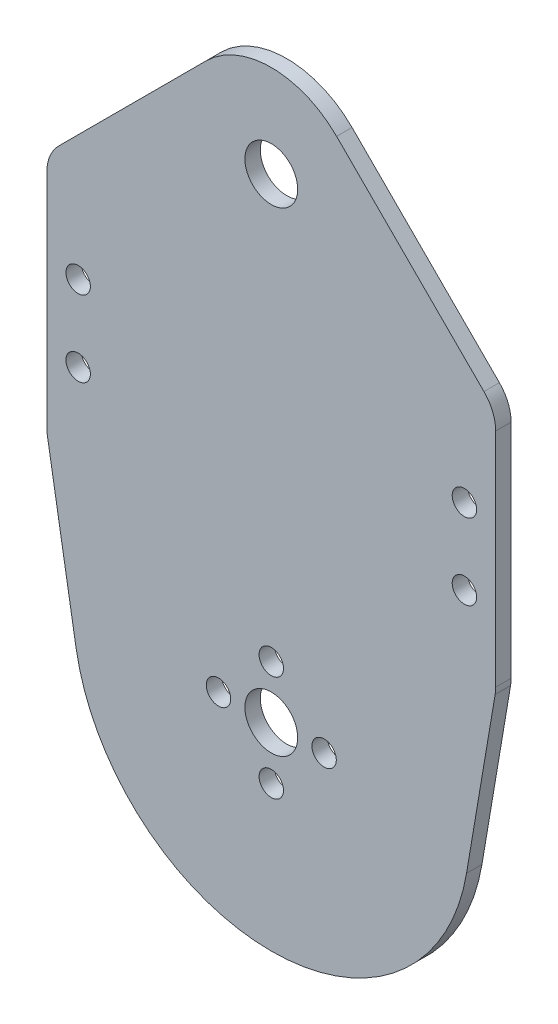
ISO-10303-21;
HEADER;
FILE_DESCRIPTION(('STEP AP214'),'2;1');
FILE_NAME('part.step','',(''),(''),'','','');
FILE_SCHEMA(('AUTOMOTIVE_DESIGN { 1 0 10303 214 1 1 1 1 }'));
ENDSEC;
DATA;
#1=APPLICATION_CONTEXT('core data for automotive mechanical design processes');
#2=APPLICATION_PROTOCOL_DEFINITION('international standard','automotive_design',2000,#1);
#3=PRODUCT_CONTEXT('',#1,'mechanical');
#4=PRODUCT('Part','Part','',(#3));
#5=PRODUCT_RELATED_PRODUCT_CATEGORY('part','',(#4));
#6=PRODUCT_DEFINITION_FORMATION('','',#4);
#7=PRODUCT_DEFINITION_CONTEXT('part definition',#1,'design');
#8=PRODUCT_DEFINITION('design','',#6,#7);
#9=PRODUCT_DEFINITION_SHAPE('','',#8);
#10=(LENGTH_UNIT() NAMED_UNIT(*) SI_UNIT(.MILLI.,.METRE.));
#11=(NAMED_UNIT(*) PLANE_ANGLE_UNIT() SI_UNIT($,.RADIAN.));
#12=(NAMED_UNIT(*) SI_UNIT($,.STERADIAN.) SOLID_ANGLE_UNIT());
#13=UNCERTAINTY_MEASURE_WITH_UNIT(LENGTH_MEASURE(1.E-05),#10,'distance_accuracy_value','');
#14=(GEOMETRIC_REPRESENTATION_CONTEXT(3) GLOBAL_UNCERTAINTY_ASSIGNED_CONTEXT((#13)) GLOBAL_UNIT_ASSIGNED_CONTEXT((#10,
#11,#12)) REPRESENTATION_CONTEXT('',''));
#15=CARTESIAN_POINT('',(0.,0.,0.));
#16=DIRECTION('',(0.,0.,1.));
#17=DIRECTION('',(1.,0.,0.));
#18=AXIS2_PLACEMENT_3D('',#15,#16,#17);
#19=CARTESIAN_POINT('',(0.,0.,2.3368));
#20=DIRECTION('',(0.,0.,1.));
#21=DIRECTION('',(1.,0.,0.));
#22=AXIS2_PLACEMENT_3D('',#19,#20,#21);
#23=PLANE('',#22);
#24=CARTESIAN_POINT('',(29.2625,32.,2.3368));
#25=DIRECTION('',(0.,0.,1.));
#26=DIRECTION('',(1.,0.,0.));
#27=AXIS2_PLACEMENT_3D('',#24,#25,#26);
#28=CIRCLE('',#27,1.85);
#29=CARTESIAN_POINT('',(31.1125000000001,32.,2.3368));
#30=VERTEX_POINT('',#29);
#31=EDGE_CURVE('E315',#30,#30,#28,.T.);
#32=ORIENTED_EDGE('',*,*,#31,.F.);
#33=EDGE_LOOP('',(#32));
#34=FACE_BOUND('',#33,.T.);
#35=CARTESIAN_POINT('',(-29.2625000000001,32.,2.3368));
#36=DIRECTION('',(0.,0.,1.));
#37=DIRECTION('',(1.,0.,0.));
#38=AXIS2_PLACEMENT_3D('',#35,#36,#37);
#39=CIRCLE('',#38,1.85);
#40=CARTESIAN_POINT('',(-27.4125000000001,32.,2.3368));
#41=VERTEX_POINT('',#40);
#42=EDGE_CURVE('E327',#41,#41,#39,.T.);
#43=ORIENTED_EDGE('',*,*,#42,.F.);
#44=EDGE_LOOP('',(#43));
#45=FACE_BOUND('',#44,.T.);
#46=CARTESIAN_POINT('',(8.,0.,2.3368));
#47=DIRECTION('',(0.,0.,1.));
#48=DIRECTION('',(1.,0.,0.));
#49=AXIS2_PLACEMENT_3D('',#46,#47,#48);
#50=CIRCLE('',#49,1.85);
#51=CARTESIAN_POINT('',(9.85,0.,2.3368));
#52=VERTEX_POINT('',#51);
#53=EDGE_CURVE('E339',#52,#52,#50,.T.);
#54=ORIENTED_EDGE('',*,*,#53,.F.);
#55=EDGE_LOOP('',(#54));
#56=FACE_BOUND('',#55,.T.);
#57=CARTESIAN_POINT('',(-8.,0.,2.3368));
#58=DIRECTION('',(0.,0.,1.));
#59=DIRECTION('',(1.,0.,0.));
#60=AXIS2_PLACEMENT_3D('',#57,#58,#59);
#61=CIRCLE('',#60,1.85);
#62=CARTESIAN_POINT('',(-6.15,0.,2.3368));
#63=VERTEX_POINT('',#62);
#64=EDGE_CURVE('E351',#63,#63,#61,.T.);
#65=ORIENTED_EDGE('',*,*,#64,.F.);
#66=EDGE_LOOP('',(#65));
#67=FACE_BOUND('',#66,.T.);
#68=CARTESIAN_POINT('',(0.,0.,2.3368));
#69=DIRECTION('',(0.,0.,1.));
#70=DIRECTION('',(1.,0.,0.));
#71=AXIS2_PLACEMENT_3D('',#68,#69,#70);
#72=CIRCLE('',#71,4.);
#73=CARTESIAN_POINT('',(4.,0.,2.3368));
#74=VERTEX_POINT('',#73);
#75=EDGE_CURVE('E158',#74,#74,#72,.T.);
#76=ORIENTED_EDGE('',*,*,#75,.F.);
#77=EDGE_LOOP('',(#76));
#78=FACE_BOUND('',#77,.T.);
#79=CARTESIAN_POINT('',(0.,0.,2.3368));
#80=DIRECTION('',(0.,0.,1.));
#81=DIRECTION('',(1.,0.,0.));
#82=AXIS2_PLACEMENT_3D('',#79,#80,#81);
#83=CIRCLE('',#82,30.);
#84=CARTESIAN_POINT('',(-29.5799164746517,-5.00285332111866,2.3368));
#85=VERTEX_POINT('',#84);
#86=CARTESIAN_POINT('',(29.5799164746517,-5.00285332111874,2.3368));
#87=VERTEX_POINT('',#86);
#88=EDGE_CURVE('E177',#85,#87,#83,.T.);
#89=ORIENTED_EDGE('',*,*,#88,.T.);
#90=DIRECTION('',(0.166761777370625,0.985997215821723,0.));
#91=VECTOR('',#90,1.);
#92=CARTESIAN_POINT('',(29.5799164746517,-5.00285332111874,2.3368));
#93=LINE('',#92,#91);
#94=CARTESIAN_POINT('',(33.91509068309,20.6293375023359,2.3368));
#95=VERTEX_POINT('',#94);
#96=EDGE_CURVE('E105',#87,#95,#93,.T.);
#97=ORIENTED_EDGE('',*,*,#96,.T.);
#98=CARTESIAN_POINT('',(27.9362546884231,21.6405384480172,2.3368));
#99=DIRECTION('',(0.,0.,1.));
#100=DIRECTION('',(1.,0.,0.));
#101=AXIS2_PLACEMENT_3D('',#98,#99,#100);
#102=CIRCLE('',#101,6.06374531157695);
#103=CARTESIAN_POINT('',(34.,21.6405384480172,2.3368));
#104=VERTEX_POINT('',#103);
#105=EDGE_CURVE('E204',#95,#104,#102,.T.);
#106=ORIENTED_EDGE('',*,*,#105,.T.);
#107=DIRECTION('',(0.,1.,0.));
#108=VECTOR('',#107,1.);
#109=CARTESIAN_POINT('',(34.,21.6405384480172,2.3368));
#110=LINE('',#109,#108);
#111=CARTESIAN_POINT('',(34.0000000000001,55.2473043263916,2.3368));
#112=VERTEX_POINT('',#111);
#113=EDGE_CURVE('E223',#104,#112,#110,.T.);
#114=ORIENTED_EDGE('',*,*,#113,.T.);
#115=CARTESIAN_POINT('',(27.9362546884231,55.2473043263916,2.3368));
#116=DIRECTION('',(0.,0.,1.));
#117=DIRECTION('',(1.,0.,0.));
#118=AXIS2_PLACEMENT_3D('',#115,#116,#117);
#119=CIRCLE('',#118,6.06374531157696);
#120=CARTESIAN_POINT('',(32.2239701176273,59.5350197555958,2.3368));
#121=VERTEX_POINT('',#120);
#122=EDGE_CURVE('E220',#112,#121,#119,.T.);
#123=ORIENTED_EDGE('',*,*,#122,.T.);
#124=DIRECTION('',(-0.707106781186544,0.707106781186551,0.));
#125=VECTOR('',#124,1.);
#126=CARTESIAN_POINT('',(32.2239701176273,59.5350197555958,2.3368));
#127=LINE('',#126,#125);
#128=CARTESIAN_POINT('',(9.89949493661178,81.8594949366116,2.3368));
#129=VERTEX_POINT('',#128);
#130=EDGE_CURVE('E222',#121,#129,#127,.T.);
#131=ORIENTED_EDGE('',*,*,#130,.T.);
#132=CARTESIAN_POINT('',(0.,71.96,2.3368));
#133=DIRECTION('',(0.,0.,1.));
#134=DIRECTION('',(1.,0.,0.));
#135=AXIS2_PLACEMENT_3D('',#132,#133,#134);
#136=CIRCLE('',#135,14.);
#137=CARTESIAN_POINT('',(-9.89949493661165,81.8594949366116,2.3368));
#138=VERTEX_POINT('',#137);
#139=EDGE_CURVE('E225',#129,#138,#136,.T.);
#140=ORIENTED_EDGE('',*,*,#139,.T.);
#141=DIRECTION('',(-0.707106781186544,-0.707106781186551,0.));
#142=VECTOR('',#141,1.);
#143=CARTESIAN_POINT('',(-9.89949493661165,81.8594949366116,2.3368));
#144=LINE('',#143,#142);
#145=CARTESIAN_POINT('',(-32.2239701176272,59.5350197555958,2.3368));
#146=VERTEX_POINT('',#145);
#147=EDGE_CURVE('E231',#138,#146,#144,.T.);
#148=ORIENTED_EDGE('',*,*,#147,.T.);
#149=CARTESIAN_POINT('',(-27.936254688423,55.2473043263916,2.3368));
#150=DIRECTION('',(0.,0.,1.));
#151=DIRECTION('',(1.,0.,0.));
#152=AXIS2_PLACEMENT_3D('',#149,#150,#151);
#153=CIRCLE('',#152,6.06374531157692);
#154=CARTESIAN_POINT('',(-33.9999999999999,55.2473043263916,2.3368));
#155=VERTEX_POINT('',#154);
#156=EDGE_CURVE('E136',#146,#155,#153,.T.);
#157=ORIENTED_EDGE('',*,*,#156,.T.);
#158=DIRECTION('',(0.,-1.,0.));
#159=VECTOR('',#158,1.);
#160=CARTESIAN_POINT('',(-34.,21.6405384480173,2.3368));
#161=LINE('',#160,#159);
#162=CARTESIAN_POINT('',(-34.,21.6405384480173,2.3368));
#163=VERTEX_POINT('',#162);
#164=EDGE_CURVE('E130',#155,#163,#161,.T.);
#165=ORIENTED_EDGE('',*,*,#164,.T.);
#166=CARTESIAN_POINT('',(-27.936254688423,21.6405384480173,2.3368));
#167=DIRECTION('',(0.,0.,1.));
#168=DIRECTION('',(1.,0.,0.));
#169=AXIS2_PLACEMENT_3D('',#166,#167,#168);
#170=CIRCLE('',#169,6.06374531157696);
#171=CARTESIAN_POINT('',(-33.9150906830899,20.6293375023359,2.3368));
#172=VERTEX_POINT('',#171);
#173=EDGE_CURVE('E134',#163,#172,#170,.T.);
#174=ORIENTED_EDGE('',*,*,#173,.T.);
#175=DIRECTION('',(0.166761777370622,-0.985997215821724,0.));
#176=VECTOR('',#175,1.);
#177=CARTESIAN_POINT('',(-29.5799164746517,-5.00285332111866,2.3368));
#178=LINE('',#177,#176);
#179=EDGE_CURVE('E50',#172,#85,#178,.T.);
#180=ORIENTED_EDGE('',*,*,#179,.T.);
#181=EDGE_LOOP('',(#89,#97,#106,#114,#123,#131,#140,#148,#157,#165,#174,#180));
#182=FACE_BOUND('',#181,.T.);
#183=CARTESIAN_POINT('',(0.,8.,2.3368));
#184=DIRECTION('',(0.,0.,1.));
#185=DIRECTION('',(1.,0.,0.));
#186=AXIS2_PLACEMENT_3D('',#183,#184,#185);
#187=CIRCLE('',#186,1.85);
#188=CARTESIAN_POINT('',(1.85,8.,2.3368));
#189=VERTEX_POINT('',#188);
#190=EDGE_CURVE('E357',#189,#189,#187,.T.);
#191=ORIENTED_EDGE('',*,*,#190,.F.);
#192=EDGE_LOOP('',(#191));
#193=FACE_BOUND('',#192,.T.);
#194=CARTESIAN_POINT('',(0.,-8.,2.3368));
#195=DIRECTION('',(0.,0.,1.));
#196=DIRECTION('',(1.,0.,0.));
#197=AXIS2_PLACEMENT_3D('',#194,#195,#196);
#198=CIRCLE('',#197,1.85);
#199=CARTESIAN_POINT('',(1.85,-8.,2.3368));
#200=VERTEX_POINT('',#199);
#201=EDGE_CURVE('E345',#200,#200,#198,.T.);
#202=ORIENTED_EDGE('',*,*,#201,.F.);
#203=EDGE_LOOP('',(#202));
#204=FACE_BOUND('',#203,.T.);
#205=CARTESIAN_POINT('',(0.,71.96,2.3368));
#206=DIRECTION('',(0.,0.,1.));
#207=DIRECTION('',(1.,0.,0.));
#208=AXIS2_PLACEMENT_3D('',#205,#206,#207);
#209=CIRCLE('',#208,4.);
#210=CARTESIAN_POINT('',(4.00000000000005,71.96,2.3368));
#211=VERTEX_POINT('',#210);
#212=EDGE_CURVE('E333',#211,#211,#209,.T.);
#213=ORIENTED_EDGE('',*,*,#212,.F.);
#214=EDGE_LOOP('',(#213));
#215=FACE_BOUND('',#214,.T.);
#216=CARTESIAN_POINT('',(29.2625000000001,43.5,2.3368));
#217=DIRECTION('',(0.,0.,1.));
#218=DIRECTION('',(1.,0.,0.));
#219=AXIS2_PLACEMENT_3D('',#216,#217,#218);
#220=CIRCLE('',#219,1.85);
#221=CARTESIAN_POINT('',(31.1125000000001,43.5,2.3368));
#222=VERTEX_POINT('',#221);
#223=EDGE_CURVE('E321',#222,#222,#220,.T.);
#224=ORIENTED_EDGE('',*,*,#223,.F.);
#225=EDGE_LOOP('',(#224));
#226=FACE_BOUND('',#225,.T.);
#227=CARTESIAN_POINT('',(-29.2625000000001,43.5,2.3368));
#228=DIRECTION('',(0.,0.,1.));
#229=DIRECTION('',(1.,0.,0.));
#230=AXIS2_PLACEMENT_3D('',#227,#228,#229);
#231=CIRCLE('',#230,1.85);
#232=CARTESIAN_POINT('',(-27.4125000000001,43.5,2.3368));
#233=VERTEX_POINT('',#232);
#234=EDGE_CURVE('E306',#233,#233,#231,.T.);
#235=ORIENTED_EDGE('',*,*,#234,.F.);
#236=EDGE_LOOP('',(#235));
#237=FACE_BOUND('',#236,.T.);
#238=ADVANCED_FACE('F33',(#34,#45,#56,#67,#78,#182,#193,#204,#215,#226,#237),#23,.T.);
#239=CARTESIAN_POINT('',(0.,0.,0.));
#240=DIRECTION('',(0.,0.,1.));
#241=DIRECTION('',(1.,0.,0.));
#242=AXIS2_PLACEMENT_3D('',#239,#240,#241);
#243=PLANE('',#242);
#244=CARTESIAN_POINT('',(0.,0.,0.));
#245=DIRECTION('',(0.,0.,1.));
#246=DIRECTION('',(1.,0.,0.));
#247=AXIS2_PLACEMENT_3D('',#244,#245,#246);
#248=CIRCLE('',#247,30.);
#249=CARTESIAN_POINT('',(-29.5799164746517,-5.00285332111866,0.));
#250=VERTEX_POINT('',#249);
#251=CARTESIAN_POINT('',(29.5799164746517,-5.00285332111874,0.));
#252=VERTEX_POINT('',#251);
#253=EDGE_CURVE('E154',#250,#252,#248,.T.);
#254=ORIENTED_EDGE('',*,*,#253,.F.);
#255=DIRECTION('',(0.166761777370622,-0.985997215821724,0.));
#256=VECTOR('',#255,1.);
#257=CARTESIAN_POINT('',(-29.5799164746517,-5.00285332111866,0.));
#258=LINE('',#257,#256);
#259=CARTESIAN_POINT('',(-33.9150906830899,20.6293375023359,0.));
#260=VERTEX_POINT('',#259);
#261=EDGE_CURVE('E97',#260,#250,#258,.T.);
#262=ORIENTED_EDGE('',*,*,#261,.F.);
#263=CARTESIAN_POINT('',(-27.936254688423,21.6405384480173,0.));
#264=DIRECTION('',(0.,0.,1.));
#265=DIRECTION('',(1.,0.,0.));
#266=AXIS2_PLACEMENT_3D('',#263,#264,#265);
#267=CIRCLE('',#266,6.06374531157696);
#268=CARTESIAN_POINT('',(-34.,21.6405384480173,0.));
#269=VERTEX_POINT('',#268);
#270=EDGE_CURVE('E91',#269,#260,#267,.T.);
#271=ORIENTED_EDGE('',*,*,#270,.F.);
#272=DIRECTION('',(0.,-1.,0.));
#273=VECTOR('',#272,1.);
#274=CARTESIAN_POINT('',(-34.,21.6405384480173,0.));
#275=LINE('',#274,#273);
#276=CARTESIAN_POINT('',(-33.9999999999999,55.2473043263916,0.));
#277=VERTEX_POINT('',#276);
#278=EDGE_CURVE('E144',#277,#269,#275,.T.);
#279=ORIENTED_EDGE('',*,*,#278,.F.);
#280=CARTESIAN_POINT('',(-27.936254688423,55.2473043263916,0.));
#281=DIRECTION('',(0.,0.,1.));
#282=DIRECTION('',(1.,0.,0.));
#283=AXIS2_PLACEMENT_3D('',#280,#281,#282);
#284=CIRCLE('',#283,6.06374531157692);
#285=CARTESIAN_POINT('',(-32.2239701176272,59.5350197555958,0.));
#286=VERTEX_POINT('',#285);
#287=EDGE_CURVE('E172',#286,#277,#284,.T.);
#288=ORIENTED_EDGE('',*,*,#287,.F.);
#289=DIRECTION('',(-0.707106781186544,-0.707106781186551,0.));
#290=VECTOR('',#289,1.);
#291=CARTESIAN_POINT('',(-9.89949493661165,81.8594949366116,0.));
#292=LINE('',#291,#290);
#293=CARTESIAN_POINT('',(-9.89949493661165,81.8594949366116,0.));
#294=VERTEX_POINT('',#293);
#295=EDGE_CURVE('E170',#294,#286,#292,.T.);
#296=ORIENTED_EDGE('',*,*,#295,.F.);
#297=CARTESIAN_POINT('',(0.,71.96,0.));
#298=DIRECTION('',(0.,0.,1.));
#299=DIRECTION('',(1.,0.,0.));
#300=AXIS2_PLACEMENT_3D('',#297,#298,#299);
#301=CIRCLE('',#300,14.);
#302=CARTESIAN_POINT('',(9.89949493661178,81.8594949366116,0.));
#303=VERTEX_POINT('',#302);
#304=EDGE_CURVE('E168',#303,#294,#301,.T.);
#305=ORIENTED_EDGE('',*,*,#304,.F.);
#306=DIRECTION('',(-0.707106781186544,0.707106781186551,0.));
#307=VECTOR('',#306,1.);
#308=CARTESIAN_POINT('',(32.2239701176273,59.5350197555958,0.));
#309=LINE('',#308,#307);
#310=CARTESIAN_POINT('',(32.2239701176273,59.5350197555958,0.));
#311=VERTEX_POINT('',#310);
#312=EDGE_CURVE('E166',#311,#303,#309,.T.);
#313=ORIENTED_EDGE('',*,*,#312,.F.);
#314=CARTESIAN_POINT('',(27.9362546884231,55.2473043263916,0.));
#315=DIRECTION('',(0.,0.,1.));
#316=DIRECTION('',(1.,0.,0.));
#317=AXIS2_PLACEMENT_3D('',#314,#315,#316);
#318=CIRCLE('',#317,6.06374531157696);
#319=CARTESIAN_POINT('',(34.0000000000001,55.2473043263916,0.));
#320=VERTEX_POINT('',#319);
#321=EDGE_CURVE('E164',#320,#311,#318,.T.);
#322=ORIENTED_EDGE('',*,*,#321,.F.);
#323=DIRECTION('',(0.,1.,0.));
#324=VECTOR('',#323,1.);
#325=CARTESIAN_POINT('',(34.,21.6405384480172,0.));
#326=LINE('',#325,#324);
#327=CARTESIAN_POINT('',(34.,21.6405384480172,0.));
#328=VERTEX_POINT('',#327);
#329=EDGE_CURVE('E162',#328,#320,#326,.T.);
#330=ORIENTED_EDGE('',*,*,#329,.F.);
#331=CARTESIAN_POINT('',(27.9362546884231,21.6405384480172,0.));
#332=DIRECTION('',(0.,0.,1.));
#333=DIRECTION('',(1.,0.,0.));
#334=AXIS2_PLACEMENT_3D('',#331,#332,#333);
#335=CIRCLE('',#334,6.06374531157695);
#336=CARTESIAN_POINT('',(33.91509068309,20.6293375023359,0.));
#337=VERTEX_POINT('',#336);
#338=EDGE_CURVE('E160',#337,#328,#335,.T.);
#339=ORIENTED_EDGE('',*,*,#338,.F.);
#340=DIRECTION('',(0.166761777370625,0.985997215821723,0.));
#341=VECTOR('',#340,1.);
#342=CARTESIAN_POINT('',(29.5799164746517,-5.00285332111874,0.));
#343=LINE('',#342,#341);
#344=EDGE_CURVE('E157',#252,#337,#343,.T.);
#345=ORIENTED_EDGE('',*,*,#344,.F.);
#346=EDGE_LOOP('',(#254,#262,#271,#279,#288,#296,#305,#313,#322,#330,#339,#345));
#347=FACE_BOUND('',#346,.T.);
#348=CARTESIAN_POINT('',(0.,0.,0.));
#349=DIRECTION('',(0.,0.,1.));
#350=DIRECTION('',(1.,0.,0.));
#351=AXIS2_PLACEMENT_3D('',#348,#349,#350);
#352=CIRCLE('',#351,4.);
#353=CARTESIAN_POINT('',(4.,0.,0.));
#354=VERTEX_POINT('',#353);
#355=EDGE_CURVE('E360',#354,#354,#352,.T.);
#356=ORIENTED_EDGE('',*,*,#355,.T.);
#357=EDGE_LOOP('',(#356));
#358=FACE_BOUND('',#357,.T.);
#359=CARTESIAN_POINT('',(0.,8.,0.));
#360=DIRECTION('',(0.,0.,1.));
#361=DIRECTION('',(1.,0.,0.));
#362=AXIS2_PLACEMENT_3D('',#359,#360,#361);
#363=CIRCLE('',#362,1.85);
#364=CARTESIAN_POINT('',(1.85,8.,0.));
#365=VERTEX_POINT('',#364);
#366=EDGE_CURVE('E354',#365,#365,#363,.T.);
#367=ORIENTED_EDGE('',*,*,#366,.T.);
#368=EDGE_LOOP('',(#367));
#369=FACE_BOUND('',#368,.T.);
#370=CARTESIAN_POINT('',(-8.,0.,0.));
#371=DIRECTION('',(0.,0.,1.));
#372=DIRECTION('',(1.,0.,0.));
#373=AXIS2_PLACEMENT_3D('',#370,#371,#372);
#374=CIRCLE('',#373,1.85);
#375=CARTESIAN_POINT('',(-6.15,0.,0.));
#376=VERTEX_POINT('',#375);
#377=EDGE_CURVE('E348',#376,#376,#374,.T.);
#378=ORIENTED_EDGE('',*,*,#377,.T.);
#379=EDGE_LOOP('',(#378));
#380=FACE_BOUND('',#379,.T.);
#381=CARTESIAN_POINT('',(0.,-8.,0.));
#382=DIRECTION('',(0.,0.,1.));
#383=DIRECTION('',(1.,0.,0.));
#384=AXIS2_PLACEMENT_3D('',#381,#382,#383);
#385=CIRCLE('',#384,1.85);
#386=CARTESIAN_POINT('',(1.85,-8.,0.));
#387=VERTEX_POINT('',#386);
#388=EDGE_CURVE('E342',#387,#387,#385,.T.);
#389=ORIENTED_EDGE('',*,*,#388,.T.);
#390=EDGE_LOOP('',(#389));
#391=FACE_BOUND('',#390,.T.);
#392=CARTESIAN_POINT('',(8.,0.,0.));
#393=DIRECTION('',(0.,0.,1.));
#394=DIRECTION('',(1.,0.,0.));
#395=AXIS2_PLACEMENT_3D('',#392,#393,#394);
#396=CIRCLE('',#395,1.85);
#397=CARTESIAN_POINT('',(9.85,0.,0.));
#398=VERTEX_POINT('',#397);
#399=EDGE_CURVE('E336',#398,#398,#396,.T.);
#400=ORIENTED_EDGE('',*,*,#399,.T.);
#401=EDGE_LOOP('',(#400));
#402=FACE_BOUND('',#401,.T.);
#403=CARTESIAN_POINT('',(0.,71.96,0.));
#404=DIRECTION('',(0.,0.,1.));
#405=DIRECTION('',(1.,0.,0.));
#406=AXIS2_PLACEMENT_3D('',#403,#404,#405);
#407=CIRCLE('',#406,4.);
#408=CARTESIAN_POINT('',(4.00000000000005,71.96,0.));
#409=VERTEX_POINT('',#408);
#410=EDGE_CURVE('E330',#409,#409,#407,.T.);
#411=ORIENTED_EDGE('',*,*,#410,.T.);
#412=EDGE_LOOP('',(#411));
#413=FACE_BOUND('',#412,.T.);
#414=CARTESIAN_POINT('',(-29.2625000000001,32.,0.));
#415=DIRECTION('',(0.,0.,1.));
#416=DIRECTION('',(1.,0.,0.));
#417=AXIS2_PLACEMENT_3D('',#414,#415,#416);
#418=CIRCLE('',#417,1.85);
#419=CARTESIAN_POINT('',(-27.4125000000001,32.,0.));
#420=VERTEX_POINT('',#419);
#421=EDGE_CURVE('E324',#420,#420,#418,.T.);
#422=ORIENTED_EDGE('',*,*,#421,.T.);
#423=EDGE_LOOP('',(#422));
#424=FACE_BOUND('',#423,.T.);
#425=CARTESIAN_POINT('',(29.2625000000001,43.5,0.));
#426=DIRECTION('',(0.,0.,1.));
#427=DIRECTION('',(1.,0.,0.));
#428=AXIS2_PLACEMENT_3D('',#425,#426,#427);
#429=CIRCLE('',#428,1.85);
#430=CARTESIAN_POINT('',(31.1125000000001,43.5,0.));
#431=VERTEX_POINT('',#430);
#432=EDGE_CURVE('E318',#431,#431,#429,.T.);
#433=ORIENTED_EDGE('',*,*,#432,.T.);
#434=EDGE_LOOP('',(#433));
#435=FACE_BOUND('',#434,.T.);
#436=CARTESIAN_POINT('',(29.2625,32.,0.));
#437=DIRECTION('',(0.,0.,1.));
#438=DIRECTION('',(1.,0.,0.));
#439=AXIS2_PLACEMENT_3D('',#436,#437,#438);
#440=CIRCLE('',#439,1.85);
#441=CARTESIAN_POINT('',(31.1125000000001,32.,0.));
#442=VERTEX_POINT('',#441);
#443=EDGE_CURVE('E312',#442,#442,#440,.T.);
#444=ORIENTED_EDGE('',*,*,#443,.T.);
#445=EDGE_LOOP('',(#444));
#446=FACE_BOUND('',#445,.T.);
#447=CARTESIAN_POINT('',(-29.2625000000001,43.5,0.));
#448=DIRECTION('',(0.,0.,1.));
#449=DIRECTION('',(1.,0.,0.));
#450=AXIS2_PLACEMENT_3D('',#447,#448,#449);
#451=CIRCLE('',#450,1.85);
#452=CARTESIAN_POINT('',(-27.4125000000001,43.5,0.));
#453=VERTEX_POINT('',#452);
#454=EDGE_CURVE('E309',#453,#453,#451,.T.);
#455=ORIENTED_EDGE('',*,*,#454,.T.);
#456=EDGE_LOOP('',(#455));
#457=FACE_BOUND('',#456,.T.);
#458=ADVANCED_FACE('F208',(#347,#358,#369,#380,#391,#402,#413,#424,#435,#446,#457),#243,.F.);
#459=CARTESIAN_POINT('',(0.,0.,2.3368));
#460=DIRECTION('',(0.,0.,-1.));
#461=DIRECTION('',(-1.,0.,0.));
#462=AXIS2_PLACEMENT_3D('',#459,#460,#461);
#463=CYLINDRICAL_SURFACE('',#462,30.);
#464=ORIENTED_EDGE('',*,*,#253,.T.);
#465=DIRECTION('',(0.,0.,-1.));
#466=VECTOR('',#465,1.);
#467=CARTESIAN_POINT('',(29.5799164746517,-5.00285332111874,2.3368));
#468=LINE('',#467,#466);
#469=EDGE_CURVE('E11',#87,#252,#468,.T.);
#470=ORIENTED_EDGE('',*,*,#469,.F.);
#471=ORIENTED_EDGE('',*,*,#88,.F.);
#472=DIRECTION('',(0.,0.,-1.));
#473=VECTOR('',#472,1.);
#474=CARTESIAN_POINT('',(-29.5799164746517,-5.00285332111866,2.3368));
#475=LINE('',#474,#473);
#476=EDGE_CURVE('E150',#85,#250,#475,.T.);
#477=ORIENTED_EDGE('',*,*,#476,.T.);
#478=EDGE_LOOP('',(#464,#470,#471,#477));
#479=FACE_BOUND('',#478,.T.);
#480=ADVANCED_FACE('F35',(#479),#463,.T.);
#481=CARTESIAN_POINT('',(29.5799164746517,-5.00285332111874,2.3368));
#482=DIRECTION('',(-0.985997215821724,0.166761777370625,0.));
#483=DIRECTION('',(-0.166761777370625,-0.985997215821724,0.));
#484=AXIS2_PLACEMENT_3D('',#481,#482,#483);
#485=PLANE('',#484);
#486=ORIENTED_EDGE('',*,*,#344,.T.);
#487=DIRECTION('',(0.,0.,-1.));
#488=VECTOR('',#487,1.);
#489=CARTESIAN_POINT('',(33.91509068309,20.6293375023359,2.3368));
#490=LINE('',#489,#488);
#491=EDGE_CURVE('E42',#95,#337,#490,.T.);
#492=ORIENTED_EDGE('',*,*,#491,.F.);
#493=ORIENTED_EDGE('',*,*,#96,.F.);
#494=ORIENTED_EDGE('',*,*,#469,.T.);
#495=EDGE_LOOP('',(#486,#492,#493,#494));
#496=FACE_BOUND('',#495,.T.);
#497=ADVANCED_FACE('F524',(#496),#485,.F.);
#498=CARTESIAN_POINT('',(27.9362546884231,21.6405384480172,2.3368));
#499=DIRECTION('',(0.,0.,-1.));
#500=DIRECTION('',(-1.,0.,0.));
#501=AXIS2_PLACEMENT_3D('',#498,#499,#500);
#502=CYLINDRICAL_SURFACE('',#501,6.06374531157695);
#503=ORIENTED_EDGE('',*,*,#338,.T.);
#504=DIRECTION('',(0.,0.,-1.));
#505=VECTOR('',#504,1.);
#506=CARTESIAN_POINT('',(34.,21.6405384480172,2.3368));
#507=LINE('',#506,#505);
#508=EDGE_CURVE('E196',#104,#328,#507,.T.);
#509=ORIENTED_EDGE('',*,*,#508,.F.);
#510=ORIENTED_EDGE('',*,*,#105,.F.);
#511=ORIENTED_EDGE('',*,*,#491,.T.);
#512=EDGE_LOOP('',(#503,#509,#510,#511));
#513=FACE_BOUND('',#512,.T.);
#514=ADVANCED_FACE('F202',(#513),#502,.T.);
#515=CARTESIAN_POINT('',(34.,21.6405384480172,2.3368));
#516=DIRECTION('',(-1.,0.,0.));
#517=DIRECTION('',(0.,-1.,0.));
#518=AXIS2_PLACEMENT_3D('',#515,#516,#517);
#519=PLANE('',#518);
#520=ORIENTED_EDGE('',*,*,#329,.T.);
#521=DIRECTION('',(0.,0.,-1.));
#522=VECTOR('',#521,1.);
#523=CARTESIAN_POINT('',(34.0000000000001,55.2473043263916,2.3368));
#524=LINE('',#523,#522);
#525=EDGE_CURVE('E193',#112,#320,#524,.T.);
#526=ORIENTED_EDGE('',*,*,#525,.F.);
#527=ORIENTED_EDGE('',*,*,#113,.F.);
#528=ORIENTED_EDGE('',*,*,#508,.T.);
#529=EDGE_LOOP('',(#520,#526,#527,#528));
#530=FACE_BOUND('',#529,.T.);
#531=ADVANCED_FACE('F214',(#530),#519,.F.);
#532=CARTESIAN_POINT('',(27.9362546884231,55.2473043263916,2.3368));
#533=DIRECTION('',(0.,0.,-1.));
#534=DIRECTION('',(-1.,0.,0.));
#535=AXIS2_PLACEMENT_3D('',#532,#533,#534);
#536=CYLINDRICAL_SURFACE('',#535,6.06374531157696);
#537=ORIENTED_EDGE('',*,*,#321,.T.);
#538=DIRECTION('',(0.,0.,-1.));
#539=VECTOR('',#538,1.);
#540=CARTESIAN_POINT('',(32.2239701176273,59.5350197555958,2.3368));
#541=LINE('',#540,#539);
#542=EDGE_CURVE('E190',#121,#311,#541,.T.);
#543=ORIENTED_EDGE('',*,*,#542,.F.);
#544=ORIENTED_EDGE('',*,*,#122,.F.);
#545=ORIENTED_EDGE('',*,*,#525,.T.);
#546=EDGE_LOOP('',(#537,#543,#544,#545));
#547=FACE_BOUND('',#546,.T.);
#548=ADVANCED_FACE('F218',(#547),#536,.T.);
#549=CARTESIAN_POINT('',(32.2239701176273,59.5350197555958,2.3368));
#550=DIRECTION('',(-0.707106781186551,-0.707106781186544,0.));
#551=DIRECTION('',(0.707106781186544,-0.707106781186551,0.));
#552=AXIS2_PLACEMENT_3D('',#549,#550,#551);
#553=PLANE('',#552);
#554=ORIENTED_EDGE('',*,*,#312,.T.);
#555=DIRECTION('',(0.,0.,-1.));
#556=VECTOR('',#555,1.);
#557=CARTESIAN_POINT('',(9.89949493661178,81.8594949366116,2.3368));
#558=LINE('',#557,#556);
#559=EDGE_CURVE('E187',#129,#303,#558,.T.);
#560=ORIENTED_EDGE('',*,*,#559,.F.);
#561=ORIENTED_EDGE('',*,*,#130,.F.);
#562=ORIENTED_EDGE('',*,*,#542,.T.);
#563=EDGE_LOOP('',(#554,#560,#561,#562));
#564=FACE_BOUND('',#563,.T.);
#565=ADVANCED_FACE('F489',(#564),#553,.F.);
#566=CARTESIAN_POINT('',(0.,71.96,2.3368));
#567=DIRECTION('',(0.,0.,-1.));
#568=DIRECTION('',(-1.,0.,0.));
#569=AXIS2_PLACEMENT_3D('',#566,#567,#568);
#570=CYLINDRICAL_SURFACE('',#569,14.);
#571=ORIENTED_EDGE('',*,*,#304,.T.);
#572=DIRECTION('',(0.,0.,-1.));
#573=VECTOR('',#572,1.);
#574=CARTESIAN_POINT('',(-9.89949493661165,81.8594949366116,2.3368));
#575=LINE('',#574,#573);
#576=EDGE_CURVE('E184',#138,#294,#575,.T.);
#577=ORIENTED_EDGE('',*,*,#576,.F.);
#578=ORIENTED_EDGE('',*,*,#139,.F.);
#579=ORIENTED_EDGE('',*,*,#559,.T.);
#580=EDGE_LOOP('',(#571,#577,#578,#579));
#581=FACE_BOUND('',#580,.T.);
#582=ADVANCED_FACE('F480',(#581),#570,.T.);
#583=CARTESIAN_POINT('',(-9.89949493661165,81.8594949366116,2.3368));
#584=DIRECTION('',(0.707106781186551,-0.707106781186544,0.));
#585=DIRECTION('',(0.707106781186544,0.707106781186551,0.));
#586=AXIS2_PLACEMENT_3D('',#583,#584,#585);
#587=PLANE('',#586);
#588=ORIENTED_EDGE('',*,*,#295,.T.);
#589=DIRECTION('',(0.,0.,-1.));
#590=VECTOR('',#589,1.);
#591=CARTESIAN_POINT('',(-32.2239701176272,59.5350197555958,2.3368));
#592=LINE('',#591,#590);
#593=EDGE_CURVE('E181',#146,#286,#592,.T.);
#594=ORIENTED_EDGE('',*,*,#593,.F.);
#595=ORIENTED_EDGE('',*,*,#147,.F.);
#596=ORIENTED_EDGE('',*,*,#576,.T.);
#597=EDGE_LOOP('',(#588,#594,#595,#596));
#598=FACE_BOUND('',#597,.T.);
#599=ADVANCED_FACE('F237',(#598),#587,.F.);
#600=CARTESIAN_POINT('',(-27.936254688423,55.2473043263916,2.3368));
#601=DIRECTION('',(0.,0.,-1.));
#602=DIRECTION('',(-1.,0.,0.));
#603=AXIS2_PLACEMENT_3D('',#600,#601,#602);
#604=CYLINDRICAL_SURFACE('',#603,6.06374531157692);
#605=ORIENTED_EDGE('',*,*,#287,.T.);
#606=DIRECTION('',(0.,0.,-1.));
#607=VECTOR('',#606,1.);
#608=CARTESIAN_POINT('',(-33.9999999999999,55.2473043263916,2.3368));
#609=LINE('',#608,#607);
#610=EDGE_CURVE('E145',#155,#277,#609,.T.);
#611=ORIENTED_EDGE('',*,*,#610,.F.);
#612=ORIENTED_EDGE('',*,*,#156,.F.);
#613=ORIENTED_EDGE('',*,*,#593,.T.);
#614=EDGE_LOOP('',(#605,#611,#612,#613));
#615=FACE_BOUND('',#614,.T.);
#616=ADVANCED_FACE('F241',(#615),#604,.T.);
#617=CARTESIAN_POINT('',(-34.,21.6405384480173,2.3368));
#618=DIRECTION('',(1.,0.,0.));
#619=DIRECTION('',(0.,1.,0.));
#620=AXIS2_PLACEMENT_3D('',#617,#618,#619);
#621=PLANE('',#620);
#622=ORIENTED_EDGE('',*,*,#278,.T.);
#623=DIRECTION('',(0.,0.,-1.));
#624=VECTOR('',#623,1.);
#625=CARTESIAN_POINT('',(-34.,21.6405384480173,2.3368));
#626=LINE('',#625,#624);
#627=EDGE_CURVE('E141',#163,#269,#626,.T.);
#628=ORIENTED_EDGE('',*,*,#627,.F.);
#629=ORIENTED_EDGE('',*,*,#164,.F.);
#630=ORIENTED_EDGE('',*,*,#610,.T.);
#631=EDGE_LOOP('',(#622,#628,#629,#630));
#632=FACE_BOUND('',#631,.T.);
#633=ADVANCED_FACE('F142',(#632),#621,.F.);
#634=CARTESIAN_POINT('',(-27.936254688423,21.6405384480173,2.3368));
#635=DIRECTION('',(0.,0.,-1.));
#636=DIRECTION('',(-1.,0.,0.));
#637=AXIS2_PLACEMENT_3D('',#634,#635,#636);
#638=CYLINDRICAL_SURFACE('',#637,6.06374531157696);
#639=ORIENTED_EDGE('',*,*,#270,.T.);
#640=DIRECTION('',(0.,0.,-1.));
#641=VECTOR('',#640,1.);
#642=CARTESIAN_POINT('',(-33.9150906830899,20.6293375023359,2.3368));
#643=LINE('',#642,#641);
#644=EDGE_CURVE('E146',#172,#260,#643,.T.);
#645=ORIENTED_EDGE('',*,*,#644,.F.);
#646=ORIENTED_EDGE('',*,*,#173,.F.);
#647=ORIENTED_EDGE('',*,*,#627,.T.);
#648=EDGE_LOOP('',(#639,#645,#646,#647));
#649=FACE_BOUND('',#648,.T.);
#650=ADVANCED_FACE('F148',(#649),#638,.T.);
#651=CARTESIAN_POINT('',(-29.5799164746517,-5.00285332111866,2.3368));
#652=DIRECTION('',(0.985997215821724,0.166761777370622,0.));
#653=DIRECTION('',(-0.166761777370622,0.985997215821724,0.));
#654=AXIS2_PLACEMENT_3D('',#651,#652,#653);
#655=PLANE('',#654);
#656=ORIENTED_EDGE('',*,*,#261,.T.);
#657=ORIENTED_EDGE('',*,*,#476,.F.);
#658=ORIENTED_EDGE('',*,*,#179,.F.);
#659=ORIENTED_EDGE('',*,*,#644,.T.);
#660=EDGE_LOOP('',(#656,#657,#658,#659));
#661=FACE_BOUND('',#660,.T.);
#662=ADVANCED_FACE('F245',(#661),#655,.F.);
#663=CARTESIAN_POINT('',(0.,0.,2.3368));
#664=DIRECTION('',(0.,0.,-1.));
#665=DIRECTION('',(-1.,0.,0.));
#666=AXIS2_PLACEMENT_3D('',#663,#664,#665);
#667=CYLINDRICAL_SURFACE('',#666,4.);
#668=ORIENTED_EDGE('',*,*,#75,.T.);
#669=EDGE_LOOP('',(#668));
#670=FACE_BOUND('',#669,.T.);
#671=ORIENTED_EDGE('',*,*,#355,.F.);
#672=EDGE_LOOP('',(#671));
#673=FACE_BOUND('',#672,.T.);
#674=ADVANCED_FACE('F247',(#670,#673),#667,.F.);
#675=CARTESIAN_POINT('',(0.,8.,2.3368));
#676=DIRECTION('',(0.,0.,-1.));
#677=DIRECTION('',(-1.,0.,0.));
#678=AXIS2_PLACEMENT_3D('',#675,#676,#677);
#679=CYLINDRICAL_SURFACE('',#678,1.85);
#680=ORIENTED_EDGE('',*,*,#190,.T.);
#681=EDGE_LOOP('',(#680));
#682=FACE_BOUND('',#681,.T.);
#683=ORIENTED_EDGE('',*,*,#366,.F.);
#684=EDGE_LOOP('',(#683));
#685=FACE_BOUND('',#684,.T.);
#686=ADVANCED_FACE('F253',(#682,#685),#679,.F.);
#687=CARTESIAN_POINT('',(-8.,0.,2.3368));
#688=DIRECTION('',(0.,0.,-1.));
#689=DIRECTION('',(-1.,0.,0.));
#690=AXIS2_PLACEMENT_3D('',#687,#688,#689);
#691=CYLINDRICAL_SURFACE('',#690,1.85);
#692=ORIENTED_EDGE('',*,*,#64,.T.);
#693=EDGE_LOOP('',(#692));
#694=FACE_BOUND('',#693,.T.);
#695=ORIENTED_EDGE('',*,*,#377,.F.);
#696=EDGE_LOOP('',(#695));
#697=FACE_BOUND('',#696,.T.);
#698=ADVANCED_FACE('F269',(#694,#697),#691,.F.);
#699=CARTESIAN_POINT('',(0.,-8.,2.3368));
#700=DIRECTION('',(0.,0.,-1.));
#701=DIRECTION('',(-1.,0.,0.));
#702=AXIS2_PLACEMENT_3D('',#699,#700,#701);
#703=CYLINDRICAL_SURFACE('',#702,1.85);
#704=ORIENTED_EDGE('',*,*,#201,.T.);
#705=EDGE_LOOP('',(#704));
#706=FACE_BOUND('',#705,.T.);
#707=ORIENTED_EDGE('',*,*,#388,.F.);
#708=EDGE_LOOP('',(#707));
#709=FACE_BOUND('',#708,.T.);
#710=ADVANCED_FACE('F273',(#706,#709),#703,.F.);
#711=CARTESIAN_POINT('',(8.,0.,2.3368));
#712=DIRECTION('',(0.,0.,-1.));
#713=DIRECTION('',(-1.,0.,0.));
#714=AXIS2_PLACEMENT_3D('',#711,#712,#713);
#715=CYLINDRICAL_SURFACE('',#714,1.85);
#716=ORIENTED_EDGE('',*,*,#53,.T.);
#717=EDGE_LOOP('',(#716));
#718=FACE_BOUND('',#717,.T.);
#719=ORIENTED_EDGE('',*,*,#399,.F.);
#720=EDGE_LOOP('',(#719));
#721=FACE_BOUND('',#720,.T.);
#722=ADVANCED_FACE('F277',(#718,#721),#715,.F.);
#723=CARTESIAN_POINT('',(0.,71.96,2.3368));
#724=DIRECTION('',(0.,0.,-1.));
#725=DIRECTION('',(-1.,0.,0.));
#726=AXIS2_PLACEMENT_3D('',#723,#724,#725);
#727=CYLINDRICAL_SURFACE('',#726,4.);
#728=ORIENTED_EDGE('',*,*,#212,.T.);
#729=EDGE_LOOP('',(#728));
#730=FACE_BOUND('',#729,.T.);
#731=ORIENTED_EDGE('',*,*,#410,.F.);
#732=EDGE_LOOP('',(#731));
#733=FACE_BOUND('',#732,.T.);
#734=ADVANCED_FACE('F281',(#730,#733),#727,.F.);
#735=CARTESIAN_POINT('',(-29.2625000000001,32.,2.3368));
#736=DIRECTION('',(0.,0.,-1.));
#737=DIRECTION('',(-1.,0.,0.));
#738=AXIS2_PLACEMENT_3D('',#735,#736,#737);
#739=CYLINDRICAL_SURFACE('',#738,1.85);
#740=ORIENTED_EDGE('',*,*,#42,.T.);
#741=EDGE_LOOP('',(#740));
#742=FACE_BOUND('',#741,.T.);
#743=ORIENTED_EDGE('',*,*,#421,.F.);
#744=EDGE_LOOP('',(#743));
#745=FACE_BOUND('',#744,.T.);
#746=ADVANCED_FACE('F285',(#742,#745),#739,.F.);
#747=CARTESIAN_POINT('',(29.2625000000001,43.5,2.3368));
#748=DIRECTION('',(0.,0.,-1.));
#749=DIRECTION('',(-1.,0.,0.));
#750=AXIS2_PLACEMENT_3D('',#747,#748,#749);
#751=CYLINDRICAL_SURFACE('',#750,1.85);
#752=ORIENTED_EDGE('',*,*,#223,.T.);
#753=EDGE_LOOP('',(#752));
#754=FACE_BOUND('',#753,.T.);
#755=ORIENTED_EDGE('',*,*,#432,.F.);
#756=EDGE_LOOP('',(#755));
#757=FACE_BOUND('',#756,.T.);
#758=ADVANCED_FACE('F289',(#754,#757),#751,.F.);
#759=CARTESIAN_POINT('',(29.2625,32.,2.3368));
#760=DIRECTION('',(0.,0.,-1.));
#761=DIRECTION('',(-1.,0.,0.));
#762=AXIS2_PLACEMENT_3D('',#759,#760,#761);
#763=CYLINDRICAL_SURFACE('',#762,1.85);
#764=ORIENTED_EDGE('',*,*,#31,.T.);
#765=EDGE_LOOP('',(#764));
#766=FACE_BOUND('',#765,.T.);
#767=ORIENTED_EDGE('',*,*,#443,.F.);
#768=EDGE_LOOP('',(#767));
#769=FACE_BOUND('',#768,.T.);
#770=ADVANCED_FACE('F293',(#766,#769),#763,.F.);
#771=CARTESIAN_POINT('',(-29.2625000000001,43.5,2.3368));
#772=DIRECTION('',(0.,0.,-1.));
#773=DIRECTION('',(-1.,0.,0.));
#774=AXIS2_PLACEMENT_3D('',#771,#772,#773);
#775=CYLINDRICAL_SURFACE('',#774,1.85);
#776=ORIENTED_EDGE('',*,*,#234,.T.);
#777=EDGE_LOOP('',(#776));
#778=FACE_BOUND('',#777,.T.);
#779=ORIENTED_EDGE('',*,*,#454,.F.);
#780=EDGE_LOOP('',(#779));
#781=FACE_BOUND('',#780,.T.);
#782=ADVANCED_FACE('F297',(#778,#781),#775,.F.);
#783=CLOSED_SHELL('',(#238,#458,#480,#497,#514,#531,#548,#565,#582,#599,#616,#633,#650,#662,
#674,#686,#698,#710,#722,#734,#746,#758,#770,#782));
#784=MANIFOLD_SOLID_BREP('B2',#783);
#785=ADVANCED_BREP_SHAPE_REPRESENTATION('',(#18,#784),#14);
#786=SHAPE_DEFINITION_REPRESENTATION(#9,#785);
ENDSEC;
END-ISO-10303-21;
